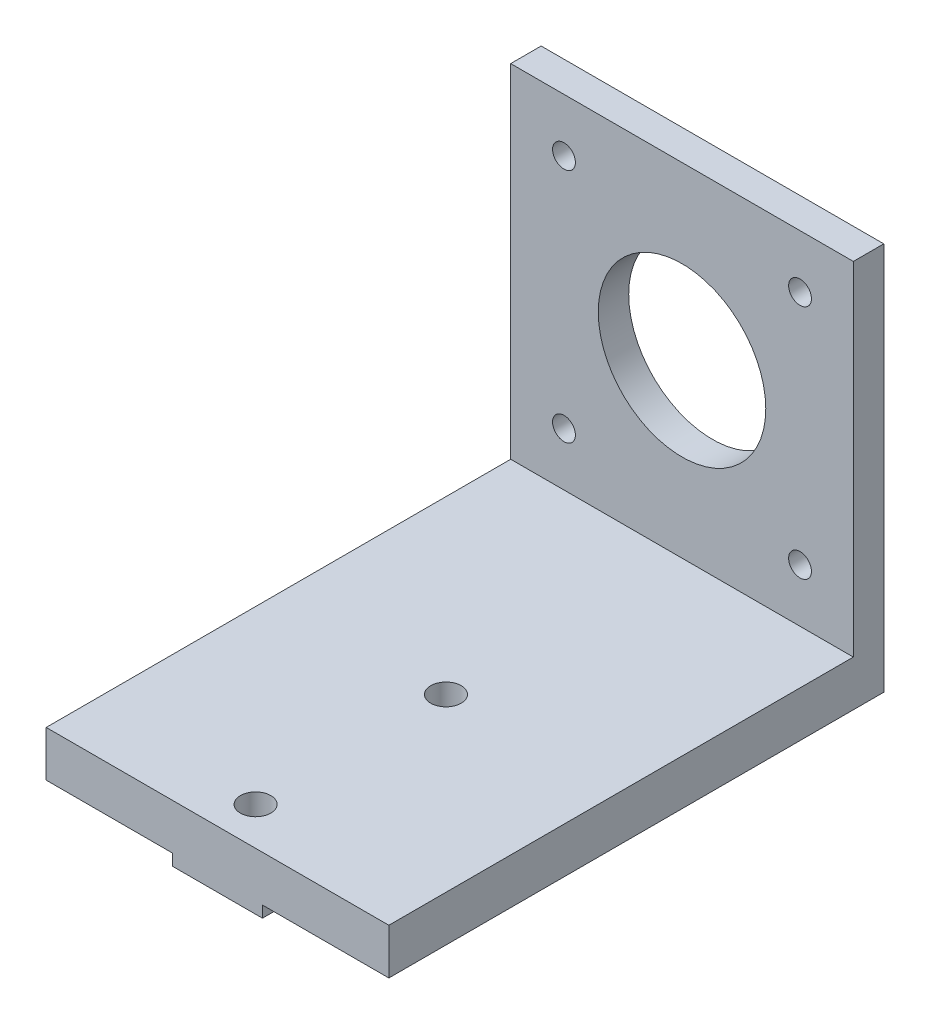
ISO-10303-21;
HEADER;
FILE_DESCRIPTION(('STEP AP214'),'2;1');
FILE_NAME('part.step','',(''),(''),'','','');
FILE_SCHEMA(('AUTOMOTIVE_DESIGN { 1 0 10303 214 1 1 1 1 }'));
ENDSEC;
DATA;
#1=APPLICATION_CONTEXT('core data for automotive mechanical design processes');
#2=APPLICATION_PROTOCOL_DEFINITION('international standard','automotive_design',2000,#1);
#3=PRODUCT_CONTEXT('',#1,'mechanical');
#4=PRODUCT('Part','Part','',(#3));
#5=PRODUCT_RELATED_PRODUCT_CATEGORY('part','',(#4));
#6=PRODUCT_DEFINITION_FORMATION('','',#4);
#7=PRODUCT_DEFINITION_CONTEXT('part definition',#1,'design');
#8=PRODUCT_DEFINITION('design','',#6,#7);
#9=PRODUCT_DEFINITION_SHAPE('','',#8);
#10=(LENGTH_UNIT() NAMED_UNIT(*) SI_UNIT(.MILLI.,.METRE.));
#11=(NAMED_UNIT(*) PLANE_ANGLE_UNIT() SI_UNIT($,.RADIAN.));
#12=(NAMED_UNIT(*) SI_UNIT($,.STERADIAN.) SOLID_ANGLE_UNIT());
#13=UNCERTAINTY_MEASURE_WITH_UNIT(LENGTH_MEASURE(1.E-05),#10,'distance_accuracy_value','');
#14=(GEOMETRIC_REPRESENTATION_CONTEXT(3) GLOBAL_UNCERTAINTY_ASSIGNED_CONTEXT((#13)) GLOBAL_UNIT_ASSIGNED_CONTEXT((#10,
#11,#12)) REPRESENTATION_CONTEXT('',''));
#15=CARTESIAN_POINT('',(0.,0.,0.));
#16=DIRECTION('',(0.,0.,1.));
#17=DIRECTION('',(1.,0.,0.));
#18=AXIS2_PLACEMENT_3D('',#15,#16,#17);
#19=CARTESIAN_POINT('',(0.,-28.5,0.));
#20=DIRECTION('',(0.,-1.,0.));
#21=DIRECTION('',(0.,0.,-1.));
#22=AXIS2_PLACEMENT_3D('',#19,#20,#21);
#23=PLANE('',#22);
#24=DIRECTION('',(-1.,0.,0.));
#25=VECTOR('',#24,1.);
#26=CARTESIAN_POINT('',(0.,-28.5,1.06620942935861E-13));
#27=LINE('',#26,#25);
#28=CARTESIAN_POINT('',(-5.89992066998547,-28.5,1.06620942935861E-13));
#29=VERTEX_POINT('',#28);
#30=CARTESIAN_POINT('',(-22.5,-28.5,1.04886219459885E-13));
#31=VERTEX_POINT('',#30);
#32=EDGE_CURVE('E116',#29,#31,#27,.T.);
#33=ORIENTED_EDGE('',*,*,#32,.F.);
#34=DIRECTION('',(0.,0.,1.));
#35=VECTOR('',#34,1.);
#36=CARTESIAN_POINT('',(-5.89992066998547,-28.5,0.));
#37=LINE('',#36,#35);
#38=CARTESIAN_POINT('',(-5.89992066998547,-28.5,65.0000000000001));
#39=VERTEX_POINT('',#38);
#40=EDGE_CURVE('E111',#29,#39,#37,.T.);
#41=ORIENTED_EDGE('',*,*,#40,.T.);
#42=DIRECTION('',(-1.,0.,0.));
#43=VECTOR('',#42,1.);
#44=CARTESIAN_POINT('',(0.,-28.5,65.0000000000001));
#45=LINE('',#44,#43);
#46=CARTESIAN_POINT('',(-22.5,-28.5,65.0000000000001));
#47=VERTEX_POINT('',#46);
#48=EDGE_CURVE('E213',#39,#47,#45,.T.);
#49=ORIENTED_EDGE('',*,*,#48,.T.);
#50=DIRECTION('',(0.,0.,-1.));
#51=VECTOR('',#50,1.);
#52=CARTESIAN_POINT('',(-22.5,-28.5,4.00000000000002));
#53=LINE('',#52,#51);
#54=EDGE_CURVE('E211',#47,#31,#53,.T.);
#55=ORIENTED_EDGE('',*,*,#54,.T.);
#56=EDGE_LOOP('',(#33,#41,#49,#55));
#57=FACE_BOUND('',#56,.T.);
#58=ADVANCED_FACE('F96',(#57),#23,.T.);
#59=CARTESIAN_POINT('',(22.5,0.,4.));
#60=DIRECTION('',(1.,0.,0.));
#61=DIRECTION('',(0.,1.,0.));
#62=AXIS2_PLACEMENT_3D('',#59,#60,#61);
#63=PLANE('',#62);
#64=DIRECTION('',(0.,-1.,0.));
#65=VECTOR('',#64,1.);
#66=CARTESIAN_POINT('',(22.5,0.,0.));
#67=LINE('',#66,#65);
#68=CARTESIAN_POINT('',(22.5,22.5,0.));
#69=VERTEX_POINT('',#68);
#70=CARTESIAN_POINT('',(22.5,-28.5,1.06620942935861E-13));
#71=VERTEX_POINT('',#70);
#72=EDGE_CURVE('E228',#69,#71,#67,.T.);
#73=ORIENTED_EDGE('',*,*,#72,.F.);
#74=DIRECTION('',(0.,0.,-1.));
#75=VECTOR('',#74,1.);
#76=CARTESIAN_POINT('',(22.5,22.5,4.));
#77=LINE('',#76,#75);
#78=CARTESIAN_POINT('',(22.5,22.5,4.));
#79=VERTEX_POINT('',#78);
#80=EDGE_CURVE('E12',#79,#69,#77,.T.);
#81=ORIENTED_EDGE('',*,*,#80,.F.);
#82=DIRECTION('',(0.,-1.,0.));
#83=VECTOR('',#82,1.);
#84=CARTESIAN_POINT('',(22.5,0.,4.));
#85=LINE('',#84,#83);
#86=CARTESIAN_POINT('',(22.5,-22.5,4.));
#87=VERTEX_POINT('',#86);
#88=EDGE_CURVE('E231',#79,#87,#85,.T.);
#89=ORIENTED_EDGE('',*,*,#88,.T.);
#90=DIRECTION('',(0.,0.,-1.));
#91=VECTOR('',#90,1.);
#92=CARTESIAN_POINT('',(22.5,-22.5,4.));
#93=LINE('',#92,#91);
#94=CARTESIAN_POINT('',(22.5,-22.5,65.0000000000001));
#95=VERTEX_POINT('',#94);
#96=EDGE_CURVE('E224',#95,#87,#93,.T.);
#97=ORIENTED_EDGE('',*,*,#96,.F.);
#98=DIRECTION('',(0.,1.,0.));
#99=VECTOR('',#98,1.);
#100=CARTESIAN_POINT('',(22.5,-28.5,65.0000000000001));
#101=LINE('',#100,#99);
#102=CARTESIAN_POINT('',(22.5,-28.5,65.0000000000001));
#103=VERTEX_POINT('',#102);
#104=EDGE_CURVE('E226',#103,#95,#101,.T.);
#105=ORIENTED_EDGE('',*,*,#104,.F.);
#106=DIRECTION('',(0.,0.,-1.));
#107=VECTOR('',#106,1.);
#108=CARTESIAN_POINT('',(22.5,-28.5,4.00000000000002));
#109=LINE('',#108,#107);
#110=EDGE_CURVE('E216',#103,#71,#109,.T.);
#111=ORIENTED_EDGE('',*,*,#110,.T.);
#112=EDGE_LOOP('',(#73,#81,#89,#97,#105,#111));
#113=FACE_BOUND('',#112,.T.);
#114=ADVANCED_FACE('F98',(#113),#63,.T.);
#115=CARTESIAN_POINT('',(0.,22.5,4.));
#116=DIRECTION('',(0.,1.,0.));
#117=DIRECTION('',(0.,0.,1.));
#118=AXIS2_PLACEMENT_3D('',#115,#116,#117);
#119=PLANE('',#118);
#120=DIRECTION('',(1.,0.,0.));
#121=VECTOR('',#120,1.);
#122=CARTESIAN_POINT('',(0.,22.5,0.));
#123=LINE('',#122,#121);
#124=CARTESIAN_POINT('',(-22.5,22.5,0.));
#125=VERTEX_POINT('',#124);
#126=EDGE_CURVE('E260',#125,#69,#123,.T.);
#127=ORIENTED_EDGE('',*,*,#126,.F.);
#128=DIRECTION('',(0.,0.,-1.));
#129=VECTOR('',#128,1.);
#130=CARTESIAN_POINT('',(-22.5,22.5,4.));
#131=LINE('',#130,#129);
#132=CARTESIAN_POINT('',(-22.5,22.5,4.));
#133=VERTEX_POINT('',#132);
#134=EDGE_CURVE('E104',#133,#125,#131,.T.);
#135=ORIENTED_EDGE('',*,*,#134,.F.);
#136=DIRECTION('',(1.,0.,0.));
#137=VECTOR('',#136,1.);
#138=CARTESIAN_POINT('',(0.,22.5,4.));
#139=LINE('',#138,#137);
#140=EDGE_CURVE('E234',#133,#79,#139,.T.);
#141=ORIENTED_EDGE('',*,*,#140,.T.);
#142=ORIENTED_EDGE('',*,*,#80,.T.);
#143=EDGE_LOOP('',(#127,#135,#141,#142));
#144=FACE_BOUND('',#143,.T.);
#145=ADVANCED_FACE('F287',(#144),#119,.T.);
#146=CARTESIAN_POINT('',(-22.5,0.,4.));
#147=DIRECTION('',(1.,0.,0.));
#148=DIRECTION('',(0.,1.,0.));
#149=AXIS2_PLACEMENT_3D('',#146,#147,#148);
#150=PLANE('',#149);
#151=DIRECTION('',(0.,-1.,0.));
#152=VECTOR('',#151,1.);
#153=CARTESIAN_POINT('',(-22.5,0.,0.));
#154=LINE('',#153,#152);
#155=EDGE_CURVE('E263',#125,#31,#154,.T.);
#156=ORIENTED_EDGE('',*,*,#155,.T.);
#157=ORIENTED_EDGE('',*,*,#54,.F.);
#158=DIRECTION('',(0.,1.,0.));
#159=VECTOR('',#158,1.);
#160=CARTESIAN_POINT('',(-22.5,-28.5,65.0000000000001));
#161=LINE('',#160,#159);
#162=CARTESIAN_POINT('',(-22.5,-22.5,65.0000000000001));
#163=VERTEX_POINT('',#162);
#164=EDGE_CURVE('E219',#47,#163,#161,.T.);
#165=ORIENTED_EDGE('',*,*,#164,.T.);
#166=DIRECTION('',(0.,0.,-1.));
#167=VECTOR('',#166,1.);
#168=CARTESIAN_POINT('',(-22.5,-22.5,4.));
#169=LINE('',#168,#167);
#170=CARTESIAN_POINT('',(-22.5,-22.5,4.));
#171=VERTEX_POINT('',#170);
#172=EDGE_CURVE('E209',#163,#171,#169,.T.);
#173=ORIENTED_EDGE('',*,*,#172,.T.);
#174=DIRECTION('',(0.,-1.,0.));
#175=VECTOR('',#174,1.);
#176=CARTESIAN_POINT('',(-22.5,0.,4.));
#177=LINE('',#176,#175);
#178=EDGE_CURVE('E238',#133,#171,#177,.T.);
#179=ORIENTED_EDGE('',*,*,#178,.F.);
#180=ORIENTED_EDGE('',*,*,#134,.T.);
#181=EDGE_LOOP('',(#156,#157,#165,#173,#179,#180));
#182=FACE_BOUND('',#181,.T.);
#183=ADVANCED_FACE('F282',(#182),#150,.F.);
#184=CARTESIAN_POINT('',(-15.499999999999,-15.5000000000001,4.));
#185=DIRECTION('',(0.,0.,-1.));
#186=DIRECTION('',(-1.,0.,0.));
#187=AXIS2_PLACEMENT_3D('',#184,#185,#186);
#188=CYLINDRICAL_SURFACE('',#187,1.5);
#189=CARTESIAN_POINT('',(-15.499999999999,-15.5000000000001,4.));
#190=DIRECTION('',(0.,0.,1.));
#191=DIRECTION('',(1.,0.,0.));
#192=AXIS2_PLACEMENT_3D('',#189,#190,#191);
#193=CIRCLE('',#192,1.5);
#194=CARTESIAN_POINT('',(-13.999999999999,-15.5000000000001,4.));
#195=VERTEX_POINT('',#194);
#196=EDGE_CURVE('E253',#195,#195,#193,.T.);
#197=ORIENTED_EDGE('',*,*,#196,.T.);
#198=EDGE_LOOP('',(#197));
#199=FACE_BOUND('',#198,.T.);
#200=CARTESIAN_POINT('',(-15.499999999999,-15.5000000000001,0.));
#201=DIRECTION('',(0.,0.,1.));
#202=DIRECTION('',(1.,0.,0.));
#203=AXIS2_PLACEMENT_3D('',#200,#201,#202);
#204=CIRCLE('',#203,1.5);
#205=CARTESIAN_POINT('',(-13.999999999999,-15.5000000000001,0.));
#206=VERTEX_POINT('',#205);
#207=EDGE_CURVE('E275',#206,#206,#204,.T.);
#208=ORIENTED_EDGE('',*,*,#207,.F.);
#209=EDGE_LOOP('',(#208));
#210=FACE_BOUND('',#209,.T.);
#211=ADVANCED_FACE('F359',(#199,#210),#188,.F.);
#212=CARTESIAN_POINT('',(15.4999999999999,15.500000000001,4.));
#213=DIRECTION('',(0.,0.,-1.));
#214=DIRECTION('',(-1.,0.,0.));
#215=AXIS2_PLACEMENT_3D('',#212,#213,#214);
#216=CYLINDRICAL_SURFACE('',#215,1.5);
#217=CARTESIAN_POINT('',(15.4999999999999,15.500000000001,4.));
#218=DIRECTION('',(0.,0.,1.));
#219=DIRECTION('',(1.,0.,0.));
#220=AXIS2_PLACEMENT_3D('',#217,#218,#219);
#221=CIRCLE('',#220,1.5);
#222=CARTESIAN_POINT('',(16.9999999999999,15.500000000001,4.));
#223=VERTEX_POINT('',#222);
#224=EDGE_CURVE('E250',#223,#223,#221,.T.);
#225=ORIENTED_EDGE('',*,*,#224,.T.);
#226=EDGE_LOOP('',(#225));
#227=FACE_BOUND('',#226,.T.);
#228=CARTESIAN_POINT('',(15.4999999999999,15.500000000001,0.));
#229=DIRECTION('',(0.,0.,1.));
#230=DIRECTION('',(1.,0.,0.));
#231=AXIS2_PLACEMENT_3D('',#228,#229,#230);
#232=CIRCLE('',#231,1.5);
#233=CARTESIAN_POINT('',(16.9999999999999,15.500000000001,0.));
#234=VERTEX_POINT('',#233);
#235=EDGE_CURVE('E272',#234,#234,#232,.T.);
#236=ORIENTED_EDGE('',*,*,#235,.F.);
#237=EDGE_LOOP('',(#236));
#238=FACE_BOUND('',#237,.T.);
#239=ADVANCED_FACE('F362',(#227,#238),#216,.F.);
#240=CARTESIAN_POINT('',(15.500000000001,-15.499999999999,4.));
#241=DIRECTION('',(0.,0.,-1.));
#242=DIRECTION('',(-1.,0.,0.));
#243=AXIS2_PLACEMENT_3D('',#240,#241,#242);
#244=CYLINDRICAL_SURFACE('',#243,1.5);
#245=CARTESIAN_POINT('',(15.500000000001,-15.499999999999,4.));
#246=DIRECTION('',(0.,0.,1.));
#247=DIRECTION('',(1.,0.,0.));
#248=AXIS2_PLACEMENT_3D('',#245,#246,#247);
#249=CIRCLE('',#248,1.5);
#250=CARTESIAN_POINT('',(17.000000000001,-15.499999999999,4.));
#251=VERTEX_POINT('',#250);
#252=EDGE_CURVE('E247',#251,#251,#249,.T.);
#253=ORIENTED_EDGE('',*,*,#252,.T.);
#254=EDGE_LOOP('',(#253));
#255=FACE_BOUND('',#254,.T.);
#256=CARTESIAN_POINT('',(15.500000000001,-15.499999999999,0.));
#257=DIRECTION('',(0.,0.,1.));
#258=DIRECTION('',(1.,0.,0.));
#259=AXIS2_PLACEMENT_3D('',#256,#257,#258);
#260=CIRCLE('',#259,1.5);
#261=CARTESIAN_POINT('',(17.000000000001,-15.499999999999,0.));
#262=VERTEX_POINT('',#261);
#263=EDGE_CURVE('E269',#262,#262,#260,.T.);
#264=ORIENTED_EDGE('',*,*,#263,.F.);
#265=EDGE_LOOP('',(#264));
#266=FACE_BOUND('',#265,.T.);
#267=ADVANCED_FACE('F366',(#255,#266),#244,.F.);
#268=CARTESIAN_POINT('',(0.,0.,4.));
#269=DIRECTION('',(0.,0.,-1.));
#270=DIRECTION('',(-1.,0.,0.));
#271=AXIS2_PLACEMENT_3D('',#268,#269,#270);
#272=CYLINDRICAL_SURFACE('',#271,11.);
#273=CARTESIAN_POINT('',(0.,0.,4.));
#274=DIRECTION('',(0.,0.,1.));
#275=DIRECTION('',(1.,0.,0.));
#276=AXIS2_PLACEMENT_3D('',#273,#274,#275);
#277=CIRCLE('',#276,11.);
#278=CARTESIAN_POINT('',(11.,0.,4.));
#279=VERTEX_POINT('',#278);
#280=EDGE_CURVE('E244',#279,#279,#277,.T.);
#281=ORIENTED_EDGE('',*,*,#280,.T.);
#282=EDGE_LOOP('',(#281));
#283=FACE_BOUND('',#282,.T.);
#284=CARTESIAN_POINT('',(0.,0.,0.));
#285=DIRECTION('',(0.,0.,1.));
#286=DIRECTION('',(1.,0.,0.));
#287=AXIS2_PLACEMENT_3D('',#284,#285,#286);
#288=CIRCLE('',#287,11.);
#289=CARTESIAN_POINT('',(11.,0.,0.));
#290=VERTEX_POINT('',#289);
#291=EDGE_CURVE('E266',#290,#290,#288,.T.);
#292=ORIENTED_EDGE('',*,*,#291,.F.);
#293=EDGE_LOOP('',(#292));
#294=FACE_BOUND('',#293,.T.);
#295=ADVANCED_FACE('F357',(#283,#294),#272,.F.);
#296=CARTESIAN_POINT('',(-15.5000000000001,15.4999999999999,4.));
#297=DIRECTION('',(0.,0.,-1.));
#298=DIRECTION('',(-1.,0.,0.));
#299=AXIS2_PLACEMENT_3D('',#296,#297,#298);
#300=CYLINDRICAL_SURFACE('',#299,1.5);
#301=CARTESIAN_POINT('',(-15.5000000000001,15.4999999999999,4.));
#302=DIRECTION('',(0.,0.,1.));
#303=DIRECTION('',(1.,0.,0.));
#304=AXIS2_PLACEMENT_3D('',#301,#302,#303);
#305=CIRCLE('',#304,1.5);
#306=CARTESIAN_POINT('',(-14.0000000000001,15.4999999999999,4.));
#307=VERTEX_POINT('',#306);
#308=EDGE_CURVE('E256',#307,#307,#305,.T.);
#309=ORIENTED_EDGE('',*,*,#308,.T.);
#310=EDGE_LOOP('',(#309));
#311=FACE_BOUND('',#310,.T.);
#312=CARTESIAN_POINT('',(-15.5000000000001,15.4999999999999,0.));
#313=DIRECTION('',(0.,0.,1.));
#314=DIRECTION('',(1.,0.,0.));
#315=AXIS2_PLACEMENT_3D('',#312,#313,#314);
#316=CIRCLE('',#315,1.5);
#317=CARTESIAN_POINT('',(-14.0000000000001,15.4999999999999,0.));
#318=VERTEX_POINT('',#317);
#319=EDGE_CURVE('E235',#318,#318,#316,.T.);
#320=ORIENTED_EDGE('',*,*,#319,.F.);
#321=EDGE_LOOP('',(#320));
#322=FACE_BOUND('',#321,.T.);
#323=ADVANCED_FACE('F352',(#311,#322),#300,.F.);
#324=CARTESIAN_POINT('',(0.,0.,4.));
#325=DIRECTION('',(0.,0.,1.));
#326=DIRECTION('',(1.,0.,0.));
#327=AXIS2_PLACEMENT_3D('',#324,#325,#326);
#328=PLANE('',#327);
#329=ORIENTED_EDGE('',*,*,#88,.F.);
#330=ORIENTED_EDGE('',*,*,#140,.F.);
#331=ORIENTED_EDGE('',*,*,#178,.T.);
#332=DIRECTION('',(1.,0.,0.));
#333=VECTOR('',#332,1.);
#334=CARTESIAN_POINT('',(0.,-22.5,4.));
#335=LINE('',#334,#333);
#336=EDGE_CURVE('E241',#171,#87,#335,.T.);
#337=ORIENTED_EDGE('',*,*,#336,.T.);
#338=EDGE_LOOP('',(#329,#330,#331,#337));
#339=FACE_BOUND('',#338,.T.);
#340=ORIENTED_EDGE('',*,*,#280,.F.);
#341=EDGE_LOOP('',(#340));
#342=FACE_BOUND('',#341,.T.);
#343=ORIENTED_EDGE('',*,*,#252,.F.);
#344=EDGE_LOOP('',(#343));
#345=FACE_BOUND('',#344,.T.);
#346=ORIENTED_EDGE('',*,*,#224,.F.);
#347=EDGE_LOOP('',(#346));
#348=FACE_BOUND('',#347,.T.);
#349=ORIENTED_EDGE('',*,*,#196,.F.);
#350=EDGE_LOOP('',(#349));
#351=FACE_BOUND('',#350,.T.);
#352=ORIENTED_EDGE('',*,*,#308,.F.);
#353=EDGE_LOOP('',(#352));
#354=FACE_BOUND('',#353,.T.);
#355=ADVANCED_FACE('F348',(#339,#342,#345,#348,#351,#354),#328,.T.);
#356=CARTESIAN_POINT('',(0.,0.,0.));
#357=DIRECTION('',(0.,0.,1.));
#358=DIRECTION('',(1.,0.,0.));
#359=AXIS2_PLACEMENT_3D('',#356,#357,#358);
#360=PLANE('',#359);
#361=ORIENTED_EDGE('',*,*,#72,.T.);
#362=CARTESIAN_POINT('',(5.9000793300146,-28.5,1.06620942935861E-13));
#363=VERTEX_POINT('',#362);
#364=EDGE_CURVE('E197',#71,#363,#27,.T.);
#365=ORIENTED_EDGE('',*,*,#364,.T.);
#366=DIRECTION('',(0.,1.,0.));
#367=VECTOR('',#366,1.);
#368=CARTESIAN_POINT('',(5.90007933001461,-30.,1.12434271754932E-13));
#369=LINE('',#368,#367);
#370=CARTESIAN_POINT('',(5.90007933001461,-30.,1.12434271754932E-13));
#371=VERTEX_POINT('',#370);
#372=EDGE_CURVE('E176',#371,#363,#369,.T.);
#373=ORIENTED_EDGE('',*,*,#372,.F.);
#374=DIRECTION('',(1.,0.,0.));
#375=VECTOR('',#374,1.);
#376=CARTESIAN_POINT('',(0.,-30.,1.13301645155262E-13));
#377=LINE('',#376,#375);
#378=CARTESIAN_POINT('',(-5.89992066998547,-30.,1.14168995230908E-13));
#379=VERTEX_POINT('',#378);
#380=EDGE_CURVE('E183',#379,#371,#377,.T.);
#381=ORIENTED_EDGE('',*,*,#380,.F.);
#382=DIRECTION('',(0.,1.,0.));
#383=VECTOR('',#382,1.);
#384=CARTESIAN_POINT('',(-5.89992066998547,-30.,1.14168995230908E-13));
#385=LINE('',#384,#383);
#386=EDGE_CURVE('E305',#379,#29,#385,.T.);
#387=ORIENTED_EDGE('',*,*,#386,.T.);
#388=ORIENTED_EDGE('',*,*,#32,.T.);
#389=ORIENTED_EDGE('',*,*,#155,.F.);
#390=ORIENTED_EDGE('',*,*,#126,.T.);
#391=EDGE_LOOP('',(#361,#365,#373,#381,#387,#388,#389,#390));
#392=FACE_BOUND('',#391,.T.);
#393=ORIENTED_EDGE('',*,*,#291,.T.);
#394=EDGE_LOOP('',(#393));
#395=FACE_BOUND('',#394,.T.);
#396=ORIENTED_EDGE('',*,*,#263,.T.);
#397=EDGE_LOOP('',(#396));
#398=FACE_BOUND('',#397,.T.);
#399=ORIENTED_EDGE('',*,*,#235,.T.);
#400=EDGE_LOOP('',(#399));
#401=FACE_BOUND('',#400,.T.);
#402=ORIENTED_EDGE('',*,*,#207,.T.);
#403=EDGE_LOOP('',(#402));
#404=FACE_BOUND('',#403,.T.);
#405=ORIENTED_EDGE('',*,*,#319,.T.);
#406=EDGE_LOOP('',(#405));
#407=FACE_BOUND('',#406,.T.);
#408=ADVANCED_FACE('F194',(#392,#395,#398,#401,#404,#407),#360,.F.);
#409=CARTESIAN_POINT('',(0.,-28.5,65.0000000000001));
#410=DIRECTION('',(0.,0.,-1.));
#411=DIRECTION('',(0.,1.,0.));
#412=AXIS2_PLACEMENT_3D('',#409,#410,#411);
#413=PLANE('',#412);
#414=DIRECTION('',(-1.,0.,0.));
#415=VECTOR('',#414,1.);
#416=CARTESIAN_POINT('',(0.,-22.5,65.0000000000001));
#417=LINE('',#416,#415);
#418=EDGE_CURVE('E222',#95,#163,#417,.T.);
#419=ORIENTED_EDGE('',*,*,#418,.T.);
#420=ORIENTED_EDGE('',*,*,#164,.F.);
#421=ORIENTED_EDGE('',*,*,#48,.F.);
#422=DIRECTION('',(0.,1.,0.));
#423=VECTOR('',#422,1.);
#424=CARTESIAN_POINT('',(-5.89992066998547,-30.,65.0000000000001));
#425=LINE('',#424,#423);
#426=CARTESIAN_POINT('',(-5.89992066998547,-30.,65.0000000000001));
#427=VERTEX_POINT('',#426);
#428=EDGE_CURVE('E203',#427,#39,#425,.T.);
#429=ORIENTED_EDGE('',*,*,#428,.F.);
#430=DIRECTION('',(1.,0.,0.));
#431=VECTOR('',#430,1.);
#432=CARTESIAN_POINT('',(0.,-30.,65.0000000000001));
#433=LINE('',#432,#431);
#434=CARTESIAN_POINT('',(5.90007933001461,-30.,65.0000000000001));
#435=VERTEX_POINT('',#434);
#436=EDGE_CURVE('E182',#427,#435,#433,.T.);
#437=ORIENTED_EDGE('',*,*,#436,.T.);
#438=DIRECTION('',(0.,1.,0.));
#439=VECTOR('',#438,1.);
#440=CARTESIAN_POINT('',(5.90007933001461,-30.,65.0000000000001));
#441=LINE('',#440,#439);
#442=CARTESIAN_POINT('',(5.9000793300146,-28.5,65.0000000000001));
#443=VERTEX_POINT('',#442);
#444=EDGE_CURVE('E178',#435,#443,#441,.T.);
#445=ORIENTED_EDGE('',*,*,#444,.T.);
#446=EDGE_CURVE('E214',#103,#443,#45,.T.);
#447=ORIENTED_EDGE('',*,*,#446,.F.);
#448=ORIENTED_EDGE('',*,*,#104,.T.);
#449=EDGE_LOOP('',(#419,#420,#421,#429,#437,#445,#447,#448));
#450=FACE_BOUND('',#449,.T.);
#451=ADVANCED_FACE('F310',(#450),#413,.F.);
#452=DIRECTION('',(0.,0.,1.));
#453=VECTOR('',#452,1.);
#454=CARTESIAN_POINT('',(5.9000793300146,-28.5,0.));
#455=LINE('',#454,#453);
#456=EDGE_CURVE('E294',#363,#443,#455,.T.);
#457=ORIENTED_EDGE('',*,*,#456,.F.);
#458=ORIENTED_EDGE('',*,*,#364,.F.);
#459=ORIENTED_EDGE('',*,*,#110,.F.);
#460=ORIENTED_EDGE('',*,*,#446,.T.);
#461=EDGE_LOOP('',(#457,#458,#459,#460));
#462=FACE_BOUND('',#461,.T.);
#463=ADVANCED_FACE('F293',(#462),#23,.T.);
#464=CARTESIAN_POINT('',(0.,-22.5,0.));
#465=DIRECTION('',(0.,-1.,0.));
#466=DIRECTION('',(0.,0.,-1.));
#467=AXIS2_PLACEMENT_3D('',#464,#465,#466);
#468=PLANE('',#467);
#469=ORIENTED_EDGE('',*,*,#336,.F.);
#470=ORIENTED_EDGE('',*,*,#172,.F.);
#471=ORIENTED_EDGE('',*,*,#418,.F.);
#472=ORIENTED_EDGE('',*,*,#96,.T.);
#473=EDGE_LOOP('',(#469,#470,#471,#472));
#474=FACE_BOUND('',#473,.T.);
#475=CARTESIAN_POINT('',(7.93300145040874E-05,-22.5,35.0000000000001));
#476=DIRECTION('',(0.,1.,0.));
#477=DIRECTION('',(0.,0.,1.));
#478=AXIS2_PLACEMENT_3D('',#475,#476,#477);
#479=CIRCLE('',#478,2.);
#480=CARTESIAN_POINT('',(7.93300145040874E-05,-22.5,37.0000000000001));
#481=VERTEX_POINT('',#480);
#482=EDGE_CURVE('E198',#481,#481,#479,.T.);
#483=ORIENTED_EDGE('',*,*,#482,.F.);
#484=EDGE_LOOP('',(#483));
#485=FACE_BOUND('',#484,.T.);
#486=CARTESIAN_POINT('',(-0.00160890328379642,-22.5,59.9999999429975));
#487=DIRECTION('',(0.,1.,0.));
#488=DIRECTION('',(0.,0.,1.));
#489=AXIS2_PLACEMENT_3D('',#486,#487,#488);
#490=CIRCLE('',#489,2.);
#491=CARTESIAN_POINT('',(-0.00160890328379642,-22.5,61.9999999429975));
#492=VERTEX_POINT('',#491);
#493=EDGE_CURVE('E201',#492,#492,#490,.T.);
#494=ORIENTED_EDGE('',*,*,#493,.F.);
#495=EDGE_LOOP('',(#494));
#496=FACE_BOUND('',#495,.T.);
#497=ADVANCED_FACE('F338',(#474,#485,#496),#468,.F.);
#498=CARTESIAN_POINT('',(-0.0016089032837734,-28.5,59.9999999429975));
#499=DIRECTION('',(0.,1.,0.));
#500=DIRECTION('',(-1.,0.,0.));
#501=AXIS2_PLACEMENT_3D('',#498,#499,#500);
#502=CYLINDRICAL_SURFACE('',#501,2.);
#503=ORIENTED_EDGE('',*,*,#493,.T.);
#504=EDGE_LOOP('',(#503));
#505=FACE_BOUND('',#504,.T.);
#506=CARTESIAN_POINT('',(-0.00160890328376764,-30.,59.9999999429975));
#507=DIRECTION('',(0.,-1.,0.));
#508=DIRECTION('',(0.,0.,-1.));
#509=AXIS2_PLACEMENT_3D('',#506,#507,#508);
#510=CIRCLE('',#509,2.);
#511=CARTESIAN_POINT('',(-0.00160890328376764,-30.,57.9999999429975));
#512=VERTEX_POINT('',#511);
#513=EDGE_CURVE('E300',#512,#512,#510,.T.);
#514=ORIENTED_EDGE('',*,*,#513,.T.);
#515=EDGE_LOOP('',(#514));
#516=FACE_BOUND('',#515,.T.);
#517=ADVANCED_FACE('F316',(#505,#516),#502,.F.);
#518=CARTESIAN_POINT('',(7.93300145271096E-05,-28.5,35.0000000000001));
#519=DIRECTION('',(0.,1.,0.));
#520=DIRECTION('',(-1.,0.,0.));
#521=AXIS2_PLACEMENT_3D('',#518,#519,#520);
#522=CYLINDRICAL_SURFACE('',#521,2.);
#523=ORIENTED_EDGE('',*,*,#482,.T.);
#524=EDGE_LOOP('',(#523));
#525=FACE_BOUND('',#524,.T.);
#526=CARTESIAN_POINT('',(7.93300145328651E-05,-30.,35.0000000000001));
#527=DIRECTION('',(0.,-1.,0.));
#528=DIRECTION('',(0.,0.,-1.));
#529=AXIS2_PLACEMENT_3D('',#526,#527,#528);
#530=CIRCLE('',#529,2.);
#531=CARTESIAN_POINT('',(7.93300145328651E-05,-30.,33.0000000000001));
#532=VERTEX_POINT('',#531);
#533=EDGE_CURVE('E296',#532,#532,#530,.T.);
#534=ORIENTED_EDGE('',*,*,#533,.T.);
#535=EDGE_LOOP('',(#534));
#536=FACE_BOUND('',#535,.T.);
#537=ADVANCED_FACE('F318',(#525,#536),#522,.F.);
#538=CARTESIAN_POINT('',(0.,-30.,0.));
#539=DIRECTION('',(0.,-1.,0.));
#540=DIRECTION('',(0.,0.,-1.));
#541=AXIS2_PLACEMENT_3D('',#538,#539,#540);
#542=PLANE('',#541);
#543=ORIENTED_EDGE('',*,*,#533,.F.);
#544=EDGE_LOOP('',(#543));
#545=FACE_BOUND('',#544,.T.);
#546=ORIENTED_EDGE('',*,*,#380,.T.);
#547=DIRECTION('',(0.,0.,1.));
#548=VECTOR('',#547,1.);
#549=CARTESIAN_POINT('',(5.90007933001461,-30.,0.));
#550=LINE('',#549,#548);
#551=EDGE_CURVE('E171',#371,#435,#550,.T.);
#552=ORIENTED_EDGE('',*,*,#551,.T.);
#553=ORIENTED_EDGE('',*,*,#436,.F.);
#554=DIRECTION('',(0.,0.,1.));
#555=VECTOR('',#554,1.);
#556=CARTESIAN_POINT('',(-5.89992066998547,-30.,0.));
#557=LINE('',#556,#555);
#558=EDGE_CURVE('E190',#379,#427,#557,.T.);
#559=ORIENTED_EDGE('',*,*,#558,.F.);
#560=EDGE_LOOP('',(#546,#552,#553,#559));
#561=FACE_BOUND('',#560,.T.);
#562=ORIENTED_EDGE('',*,*,#513,.F.);
#563=EDGE_LOOP('',(#562));
#564=FACE_BOUND('',#563,.T.);
#565=ADVANCED_FACE('F187',(#545,#561,#564),#542,.T.);
#566=CARTESIAN_POINT('',(5.90007933001461,-30.,0.));
#567=DIRECTION('',(-1.,0.,0.));
#568=DIRECTION('',(0.,-1.,0.));
#569=AXIS2_PLACEMENT_3D('',#566,#567,#568);
#570=PLANE('',#569);
#571=ORIENTED_EDGE('',*,*,#456,.T.);
#572=ORIENTED_EDGE('',*,*,#444,.F.);
#573=ORIENTED_EDGE('',*,*,#551,.F.);
#574=ORIENTED_EDGE('',*,*,#372,.T.);
#575=EDGE_LOOP('',(#571,#572,#573,#574));
#576=FACE_BOUND('',#575,.T.);
#577=ADVANCED_FACE('F174',(#576),#570,.F.);
#578=CARTESIAN_POINT('',(-5.89992066998547,-30.,0.));
#579=DIRECTION('',(-1.,0.,0.));
#580=DIRECTION('',(0.,-1.,0.));
#581=AXIS2_PLACEMENT_3D('',#578,#579,#580);
#582=PLANE('',#581);
#583=ORIENTED_EDGE('',*,*,#40,.F.);
#584=ORIENTED_EDGE('',*,*,#386,.F.);
#585=ORIENTED_EDGE('',*,*,#558,.T.);
#586=ORIENTED_EDGE('',*,*,#428,.T.);
#587=EDGE_LOOP('',(#583,#584,#585,#586));
#588=FACE_BOUND('',#587,.T.);
#589=ADVANCED_FACE('F308',(#588),#582,.T.);
#590=CLOSED_SHELL('',(#58,#114,#145,#183,#211,#239,#267,#295,#323,#355,#408,#451,#463,#497,#517,
#537,#565,#577,#589));
#591=MANIFOLD_SOLID_BREP('B2',#590);
#592=ADVANCED_BREP_SHAPE_REPRESENTATION('',(#18,#591),#14);
#593=SHAPE_DEFINITION_REPRESENTATION(#9,#592);
ENDSEC;
END-ISO-10303-21;
